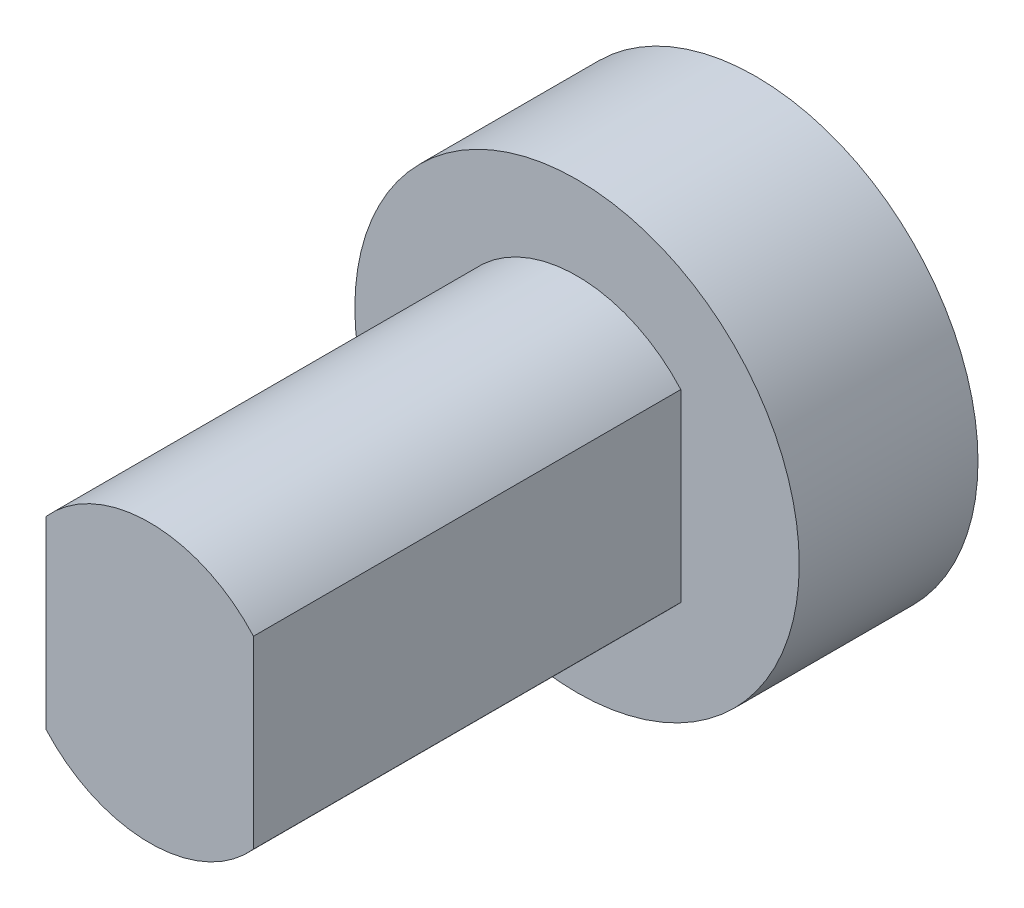
ISO-10303-21;
HEADER;
FILE_DESCRIPTION(('STEP AP214'),'2;1');
FILE_NAME('part.step','',(''),(''),'','','');
FILE_SCHEMA(('AUTOMOTIVE_DESIGN { 1 0 10303 214 1 1 1 1 }'));
ENDSEC;
DATA;
#1=APPLICATION_CONTEXT('core data for automotive mechanical design processes');
#2=APPLICATION_PROTOCOL_DEFINITION('international standard','automotive_design',2000,#1);
#3=PRODUCT_CONTEXT('',#1,'mechanical');
#4=PRODUCT('Part','Part','',(#3));
#5=PRODUCT_RELATED_PRODUCT_CATEGORY('part','',(#4));
#6=PRODUCT_DEFINITION_FORMATION('','',#4);
#7=PRODUCT_DEFINITION_CONTEXT('part definition',#1,'design');
#8=PRODUCT_DEFINITION('design','',#6,#7);
#9=PRODUCT_DEFINITION_SHAPE('','',#8);
#10=(LENGTH_UNIT() NAMED_UNIT(*) SI_UNIT(.MILLI.,.METRE.));
#11=(NAMED_UNIT(*) PLANE_ANGLE_UNIT() SI_UNIT($,.RADIAN.));
#12=(NAMED_UNIT(*) SI_UNIT($,.STERADIAN.) SOLID_ANGLE_UNIT());
#13=UNCERTAINTY_MEASURE_WITH_UNIT(LENGTH_MEASURE(1.E-05),#10,'distance_accuracy_value','');
#14=(GEOMETRIC_REPRESENTATION_CONTEXT(3) GLOBAL_UNCERTAINTY_ASSIGNED_CONTEXT((#13)) GLOBAL_UNIT_ASSIGNED_CONTEXT((#10,
#11,#12)) REPRESENTATION_CONTEXT('',''));
#15=CARTESIAN_POINT('',(0.,0.,0.));
#16=DIRECTION('',(0.,0.,1.));
#17=DIRECTION('',(1.,0.,0.));
#18=AXIS2_PLACEMENT_3D('',#15,#16,#17);
#19=CARTESIAN_POINT('',(0.,-11.0314213562373,0.));
#20=DIRECTION('',(0.,0.,1.));
#21=DIRECTION('',(1.,0.,0.));
#22=AXIS2_PLACEMENT_3D('',#19,#20,#21);
#23=PLANE('',#22);
#24=DIRECTION('',(0.,1.,0.));
#25=VECTOR('',#24,1.);
#26=CARTESIAN_POINT('',(-3.7,-11.0314213562373,0.));
#27=LINE('',#26,#25);
#28=CARTESIAN_POINT('',(-3.7,-3.28823660949147,0.));
#29=VERTEX_POINT('',#28);
#30=CARTESIAN_POINT('',(-3.7,3.28823660949147,0.));
#31=VERTEX_POINT('',#30);
#32=EDGE_CURVE('E55',#29,#31,#27,.T.);
#33=ORIENTED_EDGE('',*,*,#32,.F.);
#34=CARTESIAN_POINT('',(0.,0.,0.));
#35=DIRECTION('',(0.,0.,1.));
#36=DIRECTION('',(1.,0.,0.));
#37=AXIS2_PLACEMENT_3D('',#34,#35,#36);
#38=CIRCLE('',#37,4.95);
#39=CARTESIAN_POINT('',(3.7,-3.28823660949147,0.));
#40=VERTEX_POINT('',#39);
#41=EDGE_CURVE('E68',#40,#29,#38,.F.);
#42=ORIENTED_EDGE('',*,*,#41,.F.);
#43=DIRECTION('',(0.,1.,0.));
#44=VECTOR('',#43,1.);
#45=CARTESIAN_POINT('',(3.7,-11.0314213562373,0.));
#46=LINE('',#45,#44);
#47=CARTESIAN_POINT('',(3.7,3.28823660949147,0.));
#48=VERTEX_POINT('',#47);
#49=EDGE_CURVE('E58',#48,#40,#46,.F.);
#50=ORIENTED_EDGE('',*,*,#49,.F.);
#51=CARTESIAN_POINT('',(0.,0.,0.));
#52=DIRECTION('',(0.,0.,1.));
#53=DIRECTION('',(1.,0.,0.));
#54=AXIS2_PLACEMENT_3D('',#51,#52,#53);
#55=CIRCLE('',#54,4.95);
#56=EDGE_CURVE('E17',#31,#48,#55,.F.);
#57=ORIENTED_EDGE('',*,*,#56,.F.);
#58=EDGE_LOOP('',(#33,#42,#50,#57));
#59=FACE_BOUND('',#58,.T.);
#60=ADVANCED_FACE('F14',(#59),#23,.T.);
#61=CARTESIAN_POINT('',(0.,0.,-15.24));
#62=DIRECTION('',(0.,0.,1.));
#63=DIRECTION('',(1.,0.,0.));
#64=AXIS2_PLACEMENT_3D('',#61,#62,#63);
#65=CYLINDRICAL_SURFACE('',#64,4.95);
#66=CARTESIAN_POINT('',(0.,0.,-15.24));
#67=DIRECTION('',(0.,0.,1.));
#68=DIRECTION('',(1.,0.,0.));
#69=AXIS2_PLACEMENT_3D('',#66,#67,#68);
#70=CIRCLE('',#69,4.95);
#71=CARTESIAN_POINT('',(3.7,3.28823660949147,-15.24));
#72=VERTEX_POINT('',#71);
#73=CARTESIAN_POINT('',(-3.7,3.28823660949147,-15.24));
#74=VERTEX_POINT('',#73);
#75=EDGE_CURVE('E65',#72,#74,#70,.T.);
#76=ORIENTED_EDGE('',*,*,#75,.T.);
#77=DIRECTION('',(0.,0.,1.));
#78=VECTOR('',#77,1.);
#79=CARTESIAN_POINT('',(-3.7,3.28823660949148,-15.24));
#80=LINE('',#79,#78);
#81=EDGE_CURVE('E62',#31,#74,#80,.F.);
#82=ORIENTED_EDGE('',*,*,#81,.F.);
#83=ORIENTED_EDGE('',*,*,#56,.T.);
#84=DIRECTION('',(0.,0.,-1.));
#85=VECTOR('',#84,1.);
#86=CARTESIAN_POINT('',(3.7,3.28823660949147,-15.24));
#87=LINE('',#86,#85);
#88=EDGE_CURVE('E81',#72,#48,#87,.F.);
#89=ORIENTED_EDGE('',*,*,#88,.F.);
#90=EDGE_LOOP('',(#76,#82,#83,#89));
#91=FACE_BOUND('',#90,.T.);
#92=ADVANCED_FACE('F63',(#91),#65,.T.);
#93=CARTESIAN_POINT('',(-3.7,-11.0314213562373,-15.24));
#94=DIRECTION('',(-1.,0.,0.));
#95=DIRECTION('',(0.,0.,1.));
#96=AXIS2_PLACEMENT_3D('',#93,#94,#95);
#97=PLANE('',#96);
#98=DIRECTION('',(0.,1.,0.));
#99=VECTOR('',#98,1.);
#100=CARTESIAN_POINT('',(-3.7,0.,-15.24));
#101=LINE('',#100,#99);
#102=CARTESIAN_POINT('',(-3.7,-3.28823660949147,-15.24));
#103=VERTEX_POINT('',#102);
#104=EDGE_CURVE('E80',#74,#103,#101,.F.);
#105=ORIENTED_EDGE('',*,*,#104,.T.);
#106=DIRECTION('',(0.,0.,1.));
#107=VECTOR('',#106,1.);
#108=CARTESIAN_POINT('',(-3.7,-3.28823660949148,-15.24));
#109=LINE('',#108,#107);
#110=EDGE_CURVE('E71',#29,#103,#109,.F.);
#111=ORIENTED_EDGE('',*,*,#110,.F.);
#112=ORIENTED_EDGE('',*,*,#32,.T.);
#113=ORIENTED_EDGE('',*,*,#81,.T.);
#114=EDGE_LOOP('',(#105,#111,#112,#113));
#115=FACE_BOUND('',#114,.T.);
#116=ADVANCED_FACE('F70',(#115),#97,.T.);
#117=CARTESIAN_POINT('',(0.,0.,-15.24));
#118=DIRECTION('',(0.,0.,1.));
#119=DIRECTION('',(1.,0.,0.));
#120=AXIS2_PLACEMENT_3D('',#117,#118,#119);
#121=CYLINDRICAL_SURFACE('',#120,4.95);
#122=CARTESIAN_POINT('',(0.,0.,-15.24));
#123=DIRECTION('',(0.,0.,1.));
#124=DIRECTION('',(1.,0.,0.));
#125=AXIS2_PLACEMENT_3D('',#122,#123,#124);
#126=CIRCLE('',#125,4.95);
#127=CARTESIAN_POINT('',(3.7,-3.28823660949147,-15.24));
#128=VERTEX_POINT('',#127);
#129=EDGE_CURVE('E32',#103,#128,#126,.T.);
#130=ORIENTED_EDGE('',*,*,#129,.T.);
#131=DIRECTION('',(0.,0.,-1.));
#132=VECTOR('',#131,1.);
#133=CARTESIAN_POINT('',(3.7,-3.28823660949148,-15.24));
#134=LINE('',#133,#132);
#135=EDGE_CURVE('E83',#40,#128,#134,.T.);
#136=ORIENTED_EDGE('',*,*,#135,.F.);
#137=ORIENTED_EDGE('',*,*,#41,.T.);
#138=ORIENTED_EDGE('',*,*,#110,.T.);
#139=EDGE_LOOP('',(#130,#136,#137,#138));
#140=FACE_BOUND('',#139,.T.);
#141=ADVANCED_FACE('F106',(#140),#121,.T.);
#142=CARTESIAN_POINT('',(3.7,-11.0314213562373,-15.24));
#143=DIRECTION('',(1.,0.,0.));
#144=DIRECTION('',(0.,0.,-1.));
#145=AXIS2_PLACEMENT_3D('',#142,#143,#144);
#146=PLANE('',#145);
#147=DIRECTION('',(0.,1.,0.));
#148=VECTOR('',#147,1.);
#149=CARTESIAN_POINT('',(3.7,0.,-15.24));
#150=LINE('',#149,#148);
#151=EDGE_CURVE('E78',#128,#72,#150,.T.);
#152=ORIENTED_EDGE('',*,*,#151,.T.);
#153=ORIENTED_EDGE('',*,*,#88,.T.);
#154=ORIENTED_EDGE('',*,*,#49,.T.);
#155=ORIENTED_EDGE('',*,*,#135,.T.);
#156=EDGE_LOOP('',(#152,#153,#154,#155));
#157=FACE_BOUND('',#156,.T.);
#158=ADVANCED_FACE('F91',(#157),#146,.T.);
#159=CARTESIAN_POINT('',(0.,0.,-15.24));
#160=DIRECTION('',(0.,0.,-1.));
#161=DIRECTION('',(-1.,0.,0.));
#162=AXIS2_PLACEMENT_3D('',#159,#160,#161);
#163=PLANE('',#162);
#164=CARTESIAN_POINT('',(0.,0.,-15.24));
#165=DIRECTION('',(0.,0.,1.));
#166=DIRECTION('',(1.,0.,0.));
#167=AXIS2_PLACEMENT_3D('',#164,#165,#166);
#168=CIRCLE('',#167,7.9248);
#169=CARTESIAN_POINT('',(7.9248,0.,-15.24));
#170=VERTEX_POINT('',#169);
#171=EDGE_CURVE('E23',#170,#170,#168,.F.);
#172=ORIENTED_EDGE('',*,*,#171,.F.);
#173=EDGE_LOOP('',(#172));
#174=FACE_BOUND('',#173,.T.);
#175=ORIENTED_EDGE('',*,*,#129,.F.);
#176=ORIENTED_EDGE('',*,*,#104,.F.);
#177=ORIENTED_EDGE('',*,*,#75,.F.);
#178=ORIENTED_EDGE('',*,*,#151,.F.);
#179=EDGE_LOOP('',(#175,#176,#177,#178));
#180=FACE_BOUND('',#179,.T.);
#181=ADVANCED_FACE('F93',(#174,#180),#163,.F.);
#182=CARTESIAN_POINT('',(0.,0.,-21.6154));
#183=DIRECTION('',(0.,0.,1.));
#184=DIRECTION('',(1.,0.,0.));
#185=AXIS2_PLACEMENT_3D('',#182,#183,#184);
#186=CYLINDRICAL_SURFACE('',#185,7.9248);
#187=ORIENTED_EDGE('',*,*,#171,.T.);
#188=EDGE_LOOP('',(#187));
#189=FACE_BOUND('',#188,.T.);
#190=CARTESIAN_POINT('',(0.,0.,-21.6154));
#191=DIRECTION('',(0.,0.,1.));
#192=DIRECTION('',(1.,0.,0.));
#193=AXIS2_PLACEMENT_3D('',#190,#191,#192);
#194=CIRCLE('',#193,7.9248);
#195=CARTESIAN_POINT('',(7.9248,0.,-21.6154));
#196=VERTEX_POINT('',#195);
#197=EDGE_CURVE('E9',#196,#196,#194,.F.);
#198=ORIENTED_EDGE('',*,*,#197,.F.);
#199=EDGE_LOOP('',(#198));
#200=FACE_BOUND('',#199,.T.);
#201=ADVANCED_FACE('F95',(#189,#200),#186,.T.);
#202=CARTESIAN_POINT('',(0.,0.,-21.6154));
#203=DIRECTION('',(0.,0.,-1.));
#204=DIRECTION('',(-1.,0.,0.));
#205=AXIS2_PLACEMENT_3D('',#202,#203,#204);
#206=PLANE('',#205);
#207=ORIENTED_EDGE('',*,*,#197,.T.);
#208=EDGE_LOOP('',(#207));
#209=FACE_BOUND('',#208,.T.);
#210=ADVANCED_FACE('F103',(#209),#206,.T.);
#211=CLOSED_SHELL('',(#60,#92,#116,#141,#158,#181,#201,#210));
#212=MANIFOLD_SOLID_BREP('B1',#211);
#213=ADVANCED_BREP_SHAPE_REPRESENTATION('',(#18,#212),#14);
#214=SHAPE_DEFINITION_REPRESENTATION(#9,#213);
ENDSEC;
END-ISO-10303-21;
